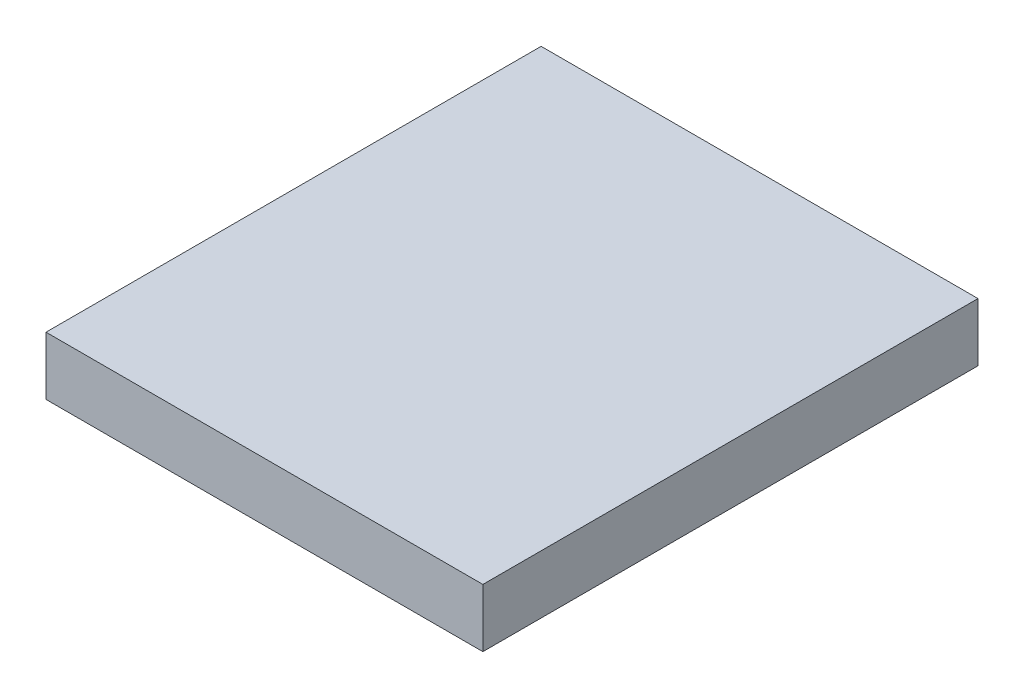
ISO-10303-21;
HEADER;
FILE_DESCRIPTION(('STEP AP214'),'2;1');
FILE_NAME('part.step','',(''),(''),'','','');
FILE_SCHEMA(('AUTOMOTIVE_DESIGN { 1 0 10303 214 1 1 1 1 }'));
ENDSEC;
DATA;
#1=APPLICATION_CONTEXT('core data for automotive mechanical design processes');
#2=APPLICATION_PROTOCOL_DEFINITION('international standard','automotive_design',2000,#1);
#3=PRODUCT_CONTEXT('',#1,'mechanical');
#4=PRODUCT('Part','Part','',(#3));
#5=PRODUCT_RELATED_PRODUCT_CATEGORY('part','',(#4));
#6=PRODUCT_DEFINITION_FORMATION('','',#4);
#7=PRODUCT_DEFINITION_CONTEXT('part definition',#1,'design');
#8=PRODUCT_DEFINITION('design','',#6,#7);
#9=PRODUCT_DEFINITION_SHAPE('','',#8);
#10=(LENGTH_UNIT() NAMED_UNIT(*) SI_UNIT(.MILLI.,.METRE.));
#11=(NAMED_UNIT(*) PLANE_ANGLE_UNIT() SI_UNIT($,.RADIAN.));
#12=(NAMED_UNIT(*) SI_UNIT($,.STERADIAN.) SOLID_ANGLE_UNIT());
#13=UNCERTAINTY_MEASURE_WITH_UNIT(LENGTH_MEASURE(1.E-05),#10,'distance_accuracy_value','');
#14=(GEOMETRIC_REPRESENTATION_CONTEXT(3) GLOBAL_UNCERTAINTY_ASSIGNED_CONTEXT((#13)) GLOBAL_UNIT_ASSIGNED_CONTEXT((#10,
#11,#12)) REPRESENTATION_CONTEXT('',''));
#15=CARTESIAN_POINT('',(0.,0.,0.));
#16=DIRECTION('',(0.,0.,1.));
#17=DIRECTION('',(1.,0.,0.));
#18=AXIS2_PLACEMENT_3D('',#15,#16,#17);
#19=CARTESIAN_POINT('',(95.25,25.4,-107.95));
#20=DIRECTION('',(-1.,0.,0.));
#21=DIRECTION('',(0.,0.,1.));
#22=AXIS2_PLACEMENT_3D('',#19,#20,#21);
#23=PLANE('',#22);
#24=DIRECTION('',(0.,0.,-1.));
#25=VECTOR('',#24,1.);
#26=CARTESIAN_POINT('',(95.25,0.,-107.95));
#27=LINE('',#26,#25);
#28=CARTESIAN_POINT('',(95.25,0.,107.95));
#29=VERTEX_POINT('',#28);
#30=CARTESIAN_POINT('',(95.25,0.,-107.95));
#31=VERTEX_POINT('',#30);
#32=EDGE_CURVE('E113',#29,#31,#27,.T.);
#33=ORIENTED_EDGE('',*,*,#32,.T.);
#34=DIRECTION('',(0.,-1.,0.));
#35=VECTOR('',#34,1.);
#36=CARTESIAN_POINT('',(95.25,25.4,-107.95));
#37=LINE('',#36,#35);
#38=CARTESIAN_POINT('',(95.25,25.4,-107.95));
#39=VERTEX_POINT('',#38);
#40=EDGE_CURVE('E11',#39,#31,#37,.T.);
#41=ORIENTED_EDGE('',*,*,#40,.F.);
#42=DIRECTION('',(0.,0.,-1.));
#43=VECTOR('',#42,1.);
#44=CARTESIAN_POINT('',(95.25,25.4,-107.95));
#45=LINE('',#44,#43);
#46=CARTESIAN_POINT('',(95.25,25.4,107.95));
#47=VERTEX_POINT('',#46);
#48=EDGE_CURVE('E97',#47,#39,#45,.T.);
#49=ORIENTED_EDGE('',*,*,#48,.F.);
#50=DIRECTION('',(0.,-1.,0.));
#51=VECTOR('',#50,1.);
#52=CARTESIAN_POINT('',(95.25,25.4,107.95));
#53=LINE('',#52,#51);
#54=EDGE_CURVE('E109',#47,#29,#53,.T.);
#55=ORIENTED_EDGE('',*,*,#54,.T.);
#56=EDGE_LOOP('',(#33,#41,#49,#55));
#57=FACE_BOUND('',#56,.T.);
#58=ADVANCED_FACE('F45',(#57),#23,.F.);
#59=CARTESIAN_POINT('',(-95.25,25.4,-107.95));
#60=DIRECTION('',(0.,0.,1.));
#61=DIRECTION('',(1.,0.,0.));
#62=AXIS2_PLACEMENT_3D('',#59,#60,#61);
#63=PLANE('',#62);
#64=DIRECTION('',(-1.,0.,0.));
#65=VECTOR('',#64,1.);
#66=CARTESIAN_POINT('',(-95.25,0.,-107.95));
#67=LINE('',#66,#65);
#68=CARTESIAN_POINT('',(-95.25,0.,-107.95));
#69=VERTEX_POINT('',#68);
#70=EDGE_CURVE('E102',#31,#69,#67,.T.);
#71=ORIENTED_EDGE('',*,*,#70,.T.);
#72=DIRECTION('',(0.,-1.,0.));
#73=VECTOR('',#72,1.);
#74=CARTESIAN_POINT('',(-95.25,25.4,-107.95));
#75=LINE('',#74,#73);
#76=CARTESIAN_POINT('',(-95.25,25.4,-107.95));
#77=VERTEX_POINT('',#76);
#78=EDGE_CURVE('E54',#77,#69,#75,.T.);
#79=ORIENTED_EDGE('',*,*,#78,.F.);
#80=DIRECTION('',(-1.,0.,0.));
#81=VECTOR('',#80,1.);
#82=CARTESIAN_POINT('',(-95.25,25.4,-107.95));
#83=LINE('',#82,#81);
#84=EDGE_CURVE('E92',#39,#77,#83,.T.);
#85=ORIENTED_EDGE('',*,*,#84,.F.);
#86=ORIENTED_EDGE('',*,*,#40,.T.);
#87=EDGE_LOOP('',(#71,#79,#85,#86));
#88=FACE_BOUND('',#87,.T.);
#89=ADVANCED_FACE('F101',(#88),#63,.F.);
#90=CARTESIAN_POINT('',(-95.25,25.4,-107.95));
#91=DIRECTION('',(1.,0.,0.));
#92=DIRECTION('',(0.,0.,-1.));
#93=AXIS2_PLACEMENT_3D('',#90,#91,#92);
#94=PLANE('',#93);
#95=DIRECTION('',(0.,0.,1.));
#96=VECTOR('',#95,1.);
#97=CARTESIAN_POINT('',(-95.25,0.,-107.95));
#98=LINE('',#97,#96);
#99=CARTESIAN_POINT('',(-95.25,0.,107.95));
#100=VERTEX_POINT('',#99);
#101=EDGE_CURVE('E79',#69,#100,#98,.T.);
#102=ORIENTED_EDGE('',*,*,#101,.T.);
#103=DIRECTION('',(0.,-1.,0.));
#104=VECTOR('',#103,1.);
#105=CARTESIAN_POINT('',(-95.25,25.4,107.95));
#106=LINE('',#105,#104);
#107=CARTESIAN_POINT('',(-95.25,25.4,107.95));
#108=VERTEX_POINT('',#107);
#109=EDGE_CURVE('E104',#108,#100,#106,.T.);
#110=ORIENTED_EDGE('',*,*,#109,.F.);
#111=DIRECTION('',(0.,0.,1.));
#112=VECTOR('',#111,1.);
#113=CARTESIAN_POINT('',(-95.25,25.4,-107.95));
#114=LINE('',#113,#112);
#115=EDGE_CURVE('E95',#77,#108,#114,.T.);
#116=ORIENTED_EDGE('',*,*,#115,.F.);
#117=ORIENTED_EDGE('',*,*,#78,.T.);
#118=EDGE_LOOP('',(#102,#110,#116,#117));
#119=FACE_BOUND('',#118,.T.);
#120=ADVANCED_FACE('F105',(#119),#94,.F.);
#121=CARTESIAN_POINT('',(-95.25,25.4,107.95));
#122=DIRECTION('',(0.,0.,-1.));
#123=DIRECTION('',(-1.,0.,0.));
#124=AXIS2_PLACEMENT_3D('',#121,#122,#123);
#125=PLANE('',#124);
#126=DIRECTION('',(1.,0.,0.));
#127=VECTOR('',#126,1.);
#128=CARTESIAN_POINT('',(-95.25,0.,107.95));
#129=LINE('',#128,#127);
#130=EDGE_CURVE('E85',#100,#29,#129,.T.);
#131=ORIENTED_EDGE('',*,*,#130,.T.);
#132=ORIENTED_EDGE('',*,*,#54,.F.);
#133=DIRECTION('',(1.,0.,0.));
#134=VECTOR('',#133,1.);
#135=CARTESIAN_POINT('',(-95.25,25.4,107.95));
#136=LINE('',#135,#134);
#137=EDGE_CURVE('E62',#108,#47,#136,.T.);
#138=ORIENTED_EDGE('',*,*,#137,.F.);
#139=ORIENTED_EDGE('',*,*,#109,.T.);
#140=EDGE_LOOP('',(#131,#132,#138,#139));
#141=FACE_BOUND('',#140,.T.);
#142=ADVANCED_FACE('F126',(#141),#125,.F.);
#143=CARTESIAN_POINT('',(0.,25.4,0.));
#144=DIRECTION('',(0.,1.,0.));
#145=DIRECTION('',(0.,0.,1.));
#146=AXIS2_PLACEMENT_3D('',#143,#144,#145);
#147=PLANE('',#146);
#148=ORIENTED_EDGE('',*,*,#48,.T.);
#149=ORIENTED_EDGE('',*,*,#84,.T.);
#150=ORIENTED_EDGE('',*,*,#115,.T.);
#151=ORIENTED_EDGE('',*,*,#137,.T.);
#152=EDGE_LOOP('',(#148,#149,#150,#151));
#153=FACE_BOUND('',#152,.T.);
#154=ADVANCED_FACE('F93',(#153),#147,.T.);
#155=CARTESIAN_POINT('',(0.,0.,0.));
#156=DIRECTION('',(0.,1.,0.));
#157=DIRECTION('',(0.,0.,1.));
#158=AXIS2_PLACEMENT_3D('',#155,#156,#157);
#159=PLANE('',#158);
#160=ORIENTED_EDGE('',*,*,#32,.F.);
#161=ORIENTED_EDGE('',*,*,#130,.F.);
#162=ORIENTED_EDGE('',*,*,#101,.F.);
#163=ORIENTED_EDGE('',*,*,#70,.F.);
#164=EDGE_LOOP('',(#160,#161,#162,#163));
#165=FACE_BOUND('',#164,.T.);
#166=ADVANCED_FACE('F129',(#165),#159,.F.);
#167=CLOSED_SHELL('',(#58,#89,#120,#142,#154,#166));
#168=MANIFOLD_SOLID_BREP('B2',#167);
#169=ADVANCED_BREP_SHAPE_REPRESENTATION('',(#18,#168),#14);
#170=SHAPE_DEFINITION_REPRESENTATION(#9,#169);
ENDSEC;
END-ISO-10303-21;
